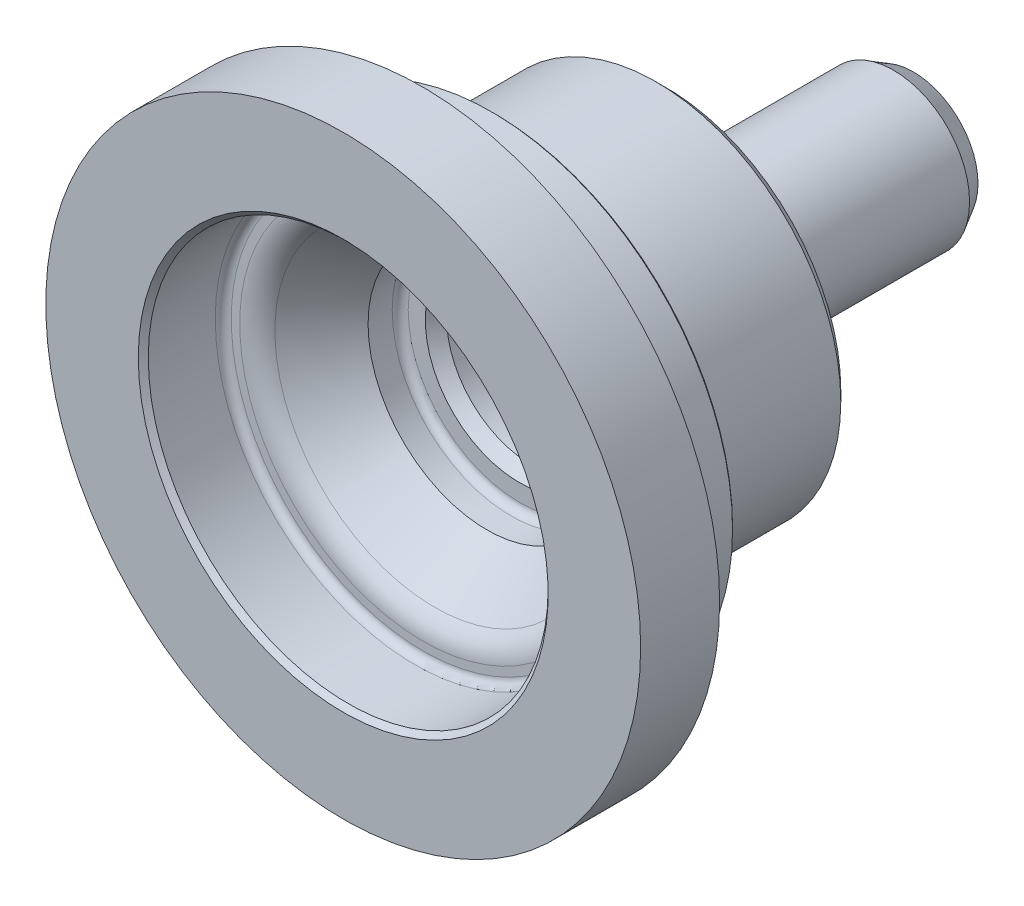
ISO-10303-21;
HEADER;
FILE_DESCRIPTION(('STEP AP214'),'2;1');
FILE_NAME('part.step','',(''),(''),'','','');
FILE_SCHEMA(('AUTOMOTIVE_DESIGN { 1 0 10303 214 1 1 1 1 }'));
ENDSEC;
DATA;
#1=APPLICATION_CONTEXT('core data for automotive mechanical design processes');
#2=APPLICATION_PROTOCOL_DEFINITION('international standard','automotive_design',2000,#1);
#3=PRODUCT_CONTEXT('',#1,'mechanical');
#4=PRODUCT('Part','Part','',(#3));
#5=PRODUCT_RELATED_PRODUCT_CATEGORY('part','',(#4));
#6=PRODUCT_DEFINITION_FORMATION('','',#4);
#7=PRODUCT_DEFINITION_CONTEXT('part definition',#1,'design');
#8=PRODUCT_DEFINITION('design','',#6,#7);
#9=PRODUCT_DEFINITION_SHAPE('','',#8);
#10=(LENGTH_UNIT() NAMED_UNIT(*) SI_UNIT(.MILLI.,.METRE.));
#11=(NAMED_UNIT(*) PLANE_ANGLE_UNIT() SI_UNIT($,.RADIAN.));
#12=(NAMED_UNIT(*) SI_UNIT($,.STERADIAN.) SOLID_ANGLE_UNIT());
#13=UNCERTAINTY_MEASURE_WITH_UNIT(LENGTH_MEASURE(1.E-05),#10,'distance_accuracy_value','');
#14=(GEOMETRIC_REPRESENTATION_CONTEXT(3) GLOBAL_UNCERTAINTY_ASSIGNED_CONTEXT((#13)) GLOBAL_UNIT_ASSIGNED_CONTEXT((#10,
#11,#12)) REPRESENTATION_CONTEXT('',''));
#15=CARTESIAN_POINT('',(0.,0.,0.));
#16=DIRECTION('',(0.,0.,1.));
#17=DIRECTION('',(1.,0.,0.));
#18=AXIS2_PLACEMENT_3D('',#15,#16,#17);
#19=CARTESIAN_POINT('',(0.,0.,-57.5));
#20=DIRECTION('',(0.,0.,1.));
#21=DIRECTION('',(1.,0.,0.));
#22=AXIS2_PLACEMENT_3D('',#19,#20,#21);
#23=PLANE('',#22);
#24=CARTESIAN_POINT('',(0.,0.,-57.5));
#25=DIRECTION('',(0.,0.,-1.));
#26=DIRECTION('',(-1.,0.,0.));
#27=AXIS2_PLACEMENT_3D('',#24,#25,#26);
#28=CIRCLE('',#27,3.35);
#29=CARTESIAN_POINT('',(-3.35,0.,-57.5));
#30=VERTEX_POINT('',#29);
#31=EDGE_CURVE('E59',#30,#30,#28,.T.);
#32=ORIENTED_EDGE('',*,*,#31,.F.);
#33=EDGE_LOOP('',(#32));
#34=FACE_BOUND('',#33,.T.);
#35=CARTESIAN_POINT('',(0.,0.,-57.5));
#36=DIRECTION('',(0.,0.,1.));
#37=DIRECTION('',(1.,0.,0.));
#38=AXIS2_PLACEMENT_3D('',#35,#36,#37);
#39=CIRCLE('',#38,5.8);
#40=CARTESIAN_POINT('',(5.8,0.,-57.5));
#41=VERTEX_POINT('',#40);
#42=EDGE_CURVE('E137',#41,#41,#39,.T.);
#43=ORIENTED_EDGE('',*,*,#42,.F.);
#44=EDGE_LOOP('',(#43));
#45=FACE_BOUND('',#44,.T.);
#46=ADVANCED_FACE('F33',(#34,#45),#23,.F.);
#47=CARTESIAN_POINT('',(0.,0.,-57.5));
#48=DIRECTION('',(0.,0.,1.));
#49=DIRECTION('',(1.,0.,0.));
#50=AXIS2_PLACEMENT_3D('',#47,#48,#49);
#51=CONICAL_SURFACE('',#50,5.8,0.959931088596885);
#52=CARTESIAN_POINT('',(0.,0.,-57.0469054236153));
#53=DIRECTION('',(0.,0.,1.));
#54=DIRECTION('',(1.,0.,0.));
#55=AXIS2_PLACEMENT_3D('',#52,#53,#54);
#56=CIRCLE('',#55,6.44708611612951);
#57=CARTESIAN_POINT('',(6.44708611612951,0.,-57.0469054236153));
#58=VERTEX_POINT('',#57);
#59=EDGE_CURVE('E134',#58,#58,#56,.T.);
#60=ORIENTED_EDGE('',*,*,#59,.F.);
#61=EDGE_LOOP('',(#60));
#62=FACE_BOUND('',#61,.T.);
#63=ORIENTED_EDGE('',*,*,#42,.T.);
#64=EDGE_LOOP('',(#63));
#65=FACE_BOUND('',#64,.T.);
#66=ADVANCED_FACE('F167',(#62,#65),#51,.T.);
#67=CARTESIAN_POINT('',(0.,0.,-57.0469054236153));
#68=DIRECTION('',(0.,0.,1.));
#69=DIRECTION('',(1.,0.,0.));
#70=AXIS2_PLACEMENT_3D('',#67,#68,#69);
#71=CONICAL_SURFACE('',#70,6.44708611612951,0.523598775598292);
#72=CARTESIAN_POINT('',(0.,0.,-55.05));
#73=DIRECTION('',(0.,0.,1.));
#74=DIRECTION('',(1.,0.,0.));
#75=AXIS2_PLACEMENT_3D('',#72,#73,#74);
#76=CIRCLE('',#75,7.6);
#77=CARTESIAN_POINT('',(7.6,0.,-55.05));
#78=VERTEX_POINT('',#77);
#79=EDGE_CURVE('E131',#78,#78,#76,.T.);
#80=ORIENTED_EDGE('',*,*,#79,.F.);
#81=EDGE_LOOP('',(#80));
#82=FACE_BOUND('',#81,.T.);
#83=ORIENTED_EDGE('',*,*,#59,.T.);
#84=EDGE_LOOP('',(#83));
#85=FACE_BOUND('',#84,.T.);
#86=ADVANCED_FACE('F173',(#82,#85),#71,.T.);
#87=CARTESIAN_POINT('',(0.,0.,0.));
#88=DIRECTION('',(0.,0.,1.));
#89=DIRECTION('',(1.,0.,0.));
#90=AXIS2_PLACEMENT_3D('',#87,#88,#89);
#91=CYLINDRICAL_SURFACE('',#90,7.6);
#92=CARTESIAN_POINT('',(0.,0.,-36.7062361110425));
#93=DIRECTION('',(0.,0.,1.));
#94=DIRECTION('',(1.,0.,0.));
#95=AXIS2_PLACEMENT_3D('',#92,#93,#94);
#96=CIRCLE('',#95,7.6);
#97=CARTESIAN_POINT('',(7.6,0.,-36.7062361110425));
#98=VERTEX_POINT('',#97);
#99=EDGE_CURVE('E128',#98,#98,#96,.T.);
#100=ORIENTED_EDGE('',*,*,#99,.F.);
#101=EDGE_LOOP('',(#100));
#102=FACE_BOUND('',#101,.T.);
#103=ORIENTED_EDGE('',*,*,#79,.T.);
#104=EDGE_LOOP('',(#103));
#105=FACE_BOUND('',#104,.T.);
#106=ADVANCED_FACE('F220',(#102,#105),#91,.T.);
#107=CARTESIAN_POINT('',(0.,0.,-35.3));
#108=DIRECTION('',(0.,0.,1.));
#109=DIRECTION('',(1.,0.,0.));
#110=AXIS2_PLACEMENT_3D('',#107,#108,#109);
#111=TOROIDAL_SURFACE('',#110,10.25,3.);
#112=CARTESIAN_POINT('',(0.,0.,-32.3));
#113=DIRECTION('',(0.,0.,1.));
#114=DIRECTION('',(1.,0.,0.));
#115=AXIS2_PLACEMENT_3D('',#112,#113,#114);
#116=CIRCLE('',#115,10.25);
#117=CARTESIAN_POINT('',(10.25,0.,-32.3));
#118=VERTEX_POINT('',#117);
#119=EDGE_CURVE('E125',#118,#118,#116,.T.);
#120=ORIENTED_EDGE('',*,*,#119,.F.);
#121=EDGE_LOOP('',(#120));
#122=FACE_BOUND('',#121,.T.);
#123=ORIENTED_EDGE('',*,*,#99,.T.);
#124=EDGE_LOOP('',(#123));
#125=FACE_BOUND('',#124,.T.);
#126=ADVANCED_FACE('F216',(#122,#125),#111,.F.);
#127=CARTESIAN_POINT('',(0.,10.25,-32.3));
#128=DIRECTION('',(0.,0.,1.));
#129=DIRECTION('',(1.,0.,0.));
#130=AXIS2_PLACEMENT_3D('',#127,#128,#129);
#131=PLANE('',#130);
#132=CARTESIAN_POINT('',(0.,0.,-32.3));
#133=DIRECTION('',(0.,0.,1.));
#134=DIRECTION('',(1.,0.,0.));
#135=AXIS2_PLACEMENT_3D('',#132,#133,#134);
#136=CIRCLE('',#135,17.47);
#137=CARTESIAN_POINT('',(17.47,0.,-32.3));
#138=VERTEX_POINT('',#137);
#139=EDGE_CURVE('E143',#138,#138,#136,.F.);
#140=ORIENTED_EDGE('',*,*,#139,.T.);
#141=EDGE_LOOP('',(#140));
#142=FACE_BOUND('',#141,.T.);
#143=ORIENTED_EDGE('',*,*,#119,.T.);
#144=EDGE_LOOP('',(#143));
#145=FACE_BOUND('',#144,.T.);
#146=ADVANCED_FACE('F197',(#142,#145),#131,.F.);
#147=CARTESIAN_POINT('',(0.,0.,0.));
#148=DIRECTION('',(0.,0.,1.));
#149=DIRECTION('',(1.,0.,0.));
#150=AXIS2_PLACEMENT_3D('',#147,#148,#149);
#151=CYLINDRICAL_SURFACE('',#150,18.47);
#152=CARTESIAN_POINT('',(0.,0.,-31.3));
#153=DIRECTION('',(0.,0.,1.));
#154=DIRECTION('',(1.,0.,0.));
#155=AXIS2_PLACEMENT_3D('',#152,#153,#154);
#156=CIRCLE('',#155,18.47);
#157=CARTESIAN_POINT('',(18.47,0.,-31.3));
#158=VERTEX_POINT('',#157);
#159=EDGE_CURVE('E140',#158,#158,#156,.T.);
#160=ORIENTED_EDGE('',*,*,#159,.T.);
#161=EDGE_LOOP('',(#160));
#162=FACE_BOUND('',#161,.T.);
#163=CARTESIAN_POINT('',(0.,0.,-18.85));
#164=DIRECTION('',(0.,0.,1.));
#165=DIRECTION('',(1.,0.,0.));
#166=AXIS2_PLACEMENT_3D('',#163,#164,#165);
#167=CIRCLE('',#166,18.47);
#168=CARTESIAN_POINT('',(18.47,0.,-18.85));
#169=VERTEX_POINT('',#168);
#170=EDGE_CURVE('E122',#169,#169,#167,.T.);
#171=ORIENTED_EDGE('',*,*,#170,.F.);
#172=EDGE_LOOP('',(#171));
#173=FACE_BOUND('',#172,.T.);
#174=ADVANCED_FACE('F193',(#162,#173),#151,.T.);
#175=CARTESIAN_POINT('',(0.,0.,-18.85));
#176=DIRECTION('',(0.,0.,-1.));
#177=DIRECTION('',(-1.,0.,0.));
#178=AXIS2_PLACEMENT_3D('',#175,#176,#177);
#179=CONICAL_SURFACE('',#178,18.47,0.523598775598301);
#180=CARTESIAN_POINT('',(0.,0.,-17.0833081762798));
#181=DIRECTION('',(0.,0.,1.));
#182=DIRECTION('',(1.,0.,0.));
#183=AXIS2_PLACEMENT_3D('',#180,#181,#182);
#184=CIRCLE('',#183,17.45);
#185=CARTESIAN_POINT('',(17.45,0.,-17.0833081762798));
#186=VERTEX_POINT('',#185);
#187=EDGE_CURVE('E119',#186,#186,#184,.T.);
#188=ORIENTED_EDGE('',*,*,#187,.F.);
#189=EDGE_LOOP('',(#188));
#190=FACE_BOUND('',#189,.T.);
#191=ORIENTED_EDGE('',*,*,#170,.T.);
#192=EDGE_LOOP('',(#191));
#193=FACE_BOUND('',#192,.T.);
#194=ADVANCED_FACE('F196',(#190,#193),#179,.T.);
#195=CARTESIAN_POINT('',(0.,0.,0.));
#196=DIRECTION('',(0.,0.,1.));
#197=DIRECTION('',(1.,0.,0.));
#198=AXIS2_PLACEMENT_3D('',#195,#196,#197);
#199=CYLINDRICAL_SURFACE('',#198,17.45);
#200=CARTESIAN_POINT('',(0.,0.,-16.07));
#201=DIRECTION('',(0.,0.,1.));
#202=DIRECTION('',(1.,0.,0.));
#203=AXIS2_PLACEMENT_3D('',#200,#201,#202);
#204=CIRCLE('',#203,17.45);
#205=CARTESIAN_POINT('',(17.45,0.,-16.07));
#206=VERTEX_POINT('',#205);
#207=EDGE_CURVE('E116',#206,#206,#204,.T.);
#208=ORIENTED_EDGE('',*,*,#207,.F.);
#209=EDGE_LOOP('',(#208));
#210=FACE_BOUND('',#209,.T.);
#211=ORIENTED_EDGE('',*,*,#187,.T.);
#212=EDGE_LOOP('',(#211));
#213=FACE_BOUND('',#212,.T.);
#214=ADVANCED_FACE('F202',(#210,#213),#199,.T.);
#215=CARTESIAN_POINT('',(0.,0.,-16.07));
#216=DIRECTION('',(0.,0.,1.));
#217=DIRECTION('',(1.,0.,0.));
#218=AXIS2_PLACEMENT_3D('',#215,#216,#217);
#219=TOROIDAL_SURFACE('',#218,18.47,1.01999999999999);
#220=CARTESIAN_POINT('',(0.,0.,-15.05));
#221=DIRECTION('',(0.,0.,1.));
#222=DIRECTION('',(1.,0.,0.));
#223=AXIS2_PLACEMENT_3D('',#220,#221,#222);
#224=CIRCLE('',#223,18.47);
#225=CARTESIAN_POINT('',(18.47,0.,-15.05));
#226=VERTEX_POINT('',#225);
#227=EDGE_CURVE('E113',#226,#226,#224,.T.);
#228=ORIENTED_EDGE('',*,*,#227,.F.);
#229=EDGE_LOOP('',(#228));
#230=FACE_BOUND('',#229,.T.);
#231=ORIENTED_EDGE('',*,*,#207,.T.);
#232=EDGE_LOOP('',(#231));
#233=FACE_BOUND('',#232,.T.);
#234=ADVANCED_FACE('F208',(#230,#233),#219,.F.);
#235=CARTESIAN_POINT('',(0.,18.47,-15.05));
#236=DIRECTION('',(0.,0.,1.));
#237=DIRECTION('',(1.,0.,0.));
#238=AXIS2_PLACEMENT_3D('',#235,#236,#237);
#239=PLANE('',#238);
#240=CARTESIAN_POINT('',(0.,0.,-15.05));
#241=DIRECTION('',(0.,0.,1.));
#242=DIRECTION('',(1.,0.,0.));
#243=AXIS2_PLACEMENT_3D('',#240,#241,#242);
#244=CIRCLE('',#243,23.8925);
#245=CARTESIAN_POINT('',(23.8925,0.,-15.05));
#246=VERTEX_POINT('',#245);
#247=EDGE_CURVE('E149',#246,#246,#244,.F.);
#248=ORIENTED_EDGE('',*,*,#247,.T.);
#249=EDGE_LOOP('',(#248));
#250=FACE_BOUND('',#249,.T.);
#251=ORIENTED_EDGE('',*,*,#227,.T.);
#252=EDGE_LOOP('',(#251));
#253=FACE_BOUND('',#252,.T.);
#254=ADVANCED_FACE('F265',(#250,#253),#239,.F.);
#255=CARTESIAN_POINT('',(0.,0.,0.));
#256=DIRECTION('',(0.,0.,1.));
#257=DIRECTION('',(1.,0.,0.));
#258=AXIS2_PLACEMENT_3D('',#255,#256,#257);
#259=CYLINDRICAL_SURFACE('',#258,24.1125);
#260=CARTESIAN_POINT('',(0.,0.,-14.83));
#261=DIRECTION('',(0.,0.,1.));
#262=DIRECTION('',(1.,0.,0.));
#263=AXIS2_PLACEMENT_3D('',#260,#261,#262);
#264=CIRCLE('',#263,24.1125);
#265=CARTESIAN_POINT('',(24.1125,0.,-14.83));
#266=VERTEX_POINT('',#265);
#267=EDGE_CURVE('E146',#266,#266,#264,.T.);
#268=ORIENTED_EDGE('',*,*,#267,.T.);
#269=EDGE_LOOP('',(#268));
#270=FACE_BOUND('',#269,.T.);
#271=CARTESIAN_POINT('',(0.,0.,-7.15));
#272=DIRECTION('',(0.,0.,1.));
#273=DIRECTION('',(1.,0.,0.));
#274=AXIS2_PLACEMENT_3D('',#271,#272,#273);
#275=CIRCLE('',#274,24.1125);
#276=CARTESIAN_POINT('',(24.1125,0.,-7.15));
#277=VERTEX_POINT('',#276);
#278=EDGE_CURVE('E110',#277,#277,#275,.T.);
#279=ORIENTED_EDGE('',*,*,#278,.F.);
#280=EDGE_LOOP('',(#279));
#281=FACE_BOUND('',#280,.T.);
#282=ADVANCED_FACE('F270',(#270,#281),#259,.T.);
#283=CARTESIAN_POINT('',(0.,0.,-7.15));
#284=DIRECTION('',(0.,0.,1.));
#285=DIRECTION('',(1.,0.,0.));
#286=AXIS2_PLACEMENT_3D('',#283,#284,#285);
#287=TOROIDAL_SURFACE('',#286,24.7125,0.599999999999999);
#288=CARTESIAN_POINT('',(0.,0.,-6.63038475772934));
#289=DIRECTION('',(0.,0.,1.));
#290=DIRECTION('',(1.,0.,0.));
#291=AXIS2_PLACEMENT_3D('',#288,#289,#290);
#292=CIRCLE('',#291,25.0125);
#293=CARTESIAN_POINT('',(25.0125,0.,-6.63038475772934));
#294=VERTEX_POINT('',#293);
#295=EDGE_CURVE('E107',#294,#294,#292,.T.);
#296=ORIENTED_EDGE('',*,*,#295,.F.);
#297=EDGE_LOOP('',(#296));
#298=FACE_BOUND('',#297,.T.);
#299=ORIENTED_EDGE('',*,*,#278,.T.);
#300=EDGE_LOOP('',(#299));
#301=FACE_BOUND('',#300,.T.);
#302=ADVANCED_FACE('F283',(#298,#301),#287,.F.);
#303=CARTESIAN_POINT('',(0.,0.,-6.63038475772934));
#304=DIRECTION('',(0.,0.,-1.));
#305=DIRECTION('',(-1.,0.,0.));
#306=AXIS2_PLACEMENT_3D('',#303,#304,#305);
#307=CONICAL_SURFACE('',#306,25.0125,1.0471975511966);
#308=CARTESIAN_POINT('',(0.,0.,-7.9));
#309=DIRECTION('',(0.,0.,1.));
#310=DIRECTION('',(1.,0.,0.));
#311=AXIS2_PLACEMENT_3D('',#308,#309,#310);
#312=CIRCLE('',#311,27.2115381056767);
#313=CARTESIAN_POINT('',(27.2115381056767,0.,-7.9));
#314=VERTEX_POINT('',#313);
#315=EDGE_CURVE('E104',#314,#314,#312,.T.);
#316=ORIENTED_EDGE('',*,*,#315,.F.);
#317=EDGE_LOOP('',(#316));
#318=FACE_BOUND('',#317,.T.);
#319=ORIENTED_EDGE('',*,*,#295,.T.);
#320=EDGE_LOOP('',(#319));
#321=FACE_BOUND('',#320,.T.);
#322=ADVANCED_FACE('F405',(#318,#321),#307,.F.);
#323=CARTESIAN_POINT('',(0.,27.2115381056767,-7.9));
#324=DIRECTION('',(0.,0.,1.));
#325=DIRECTION('',(1.,0.,0.));
#326=AXIS2_PLACEMENT_3D('',#323,#324,#325);
#327=PLANE('',#326);
#328=CARTESIAN_POINT('',(0.,0.,-7.9));
#329=DIRECTION('',(0.,0.,1.));
#330=DIRECTION('',(1.,0.,0.));
#331=AXIS2_PLACEMENT_3D('',#328,#329,#330);
#332=CIRCLE('',#331,29.75);
#333=CARTESIAN_POINT('',(29.75,0.,-7.9));
#334=VERTEX_POINT('',#333);
#335=EDGE_CURVE('E101',#334,#334,#332,.T.);
#336=ORIENTED_EDGE('',*,*,#335,.F.);
#337=EDGE_LOOP('',(#336));
#338=FACE_BOUND('',#337,.T.);
#339=ORIENTED_EDGE('',*,*,#315,.T.);
#340=EDGE_LOOP('',(#339));
#341=FACE_BOUND('',#340,.T.);
#342=ADVANCED_FACE('F401',(#338,#341),#327,.F.);
#343=CARTESIAN_POINT('',(0.,0.,0.));
#344=DIRECTION('',(0.,0.,1.));
#345=DIRECTION('',(1.,0.,0.));
#346=AXIS2_PLACEMENT_3D('',#343,#344,#345);
#347=CYLINDRICAL_SURFACE('',#346,29.75);
#348=CARTESIAN_POINT('',(0.,0.,0.));
#349=DIRECTION('',(0.,0.,1.));
#350=DIRECTION('',(1.,0.,0.));
#351=AXIS2_PLACEMENT_3D('',#348,#349,#350);
#352=CIRCLE('',#351,29.75);
#353=CARTESIAN_POINT('',(29.75,0.,0.));
#354=VERTEX_POINT('',#353);
#355=EDGE_CURVE('E98',#354,#354,#352,.T.);
#356=ORIENTED_EDGE('',*,*,#355,.F.);
#357=EDGE_LOOP('',(#356));
#358=FACE_BOUND('',#357,.T.);
#359=ORIENTED_EDGE('',*,*,#335,.T.);
#360=EDGE_LOOP('',(#359));
#361=FACE_BOUND('',#360,.T.);
#362=ADVANCED_FACE('F302',(#358,#361),#347,.T.);
#363=CARTESIAN_POINT('',(0.,29.75,0.));
#364=DIRECTION('',(0.,0.,-1.));
#365=DIRECTION('',(-1.,0.,0.));
#366=AXIS2_PLACEMENT_3D('',#363,#364,#365);
#367=PLANE('',#366);
#368=CARTESIAN_POINT('',(0.,0.,0.));
#369=DIRECTION('',(0.,0.,-1.));
#370=DIRECTION('',(-1.,0.,0.));
#371=AXIS2_PLACEMENT_3D('',#368,#369,#370);
#372=CIRCLE('',#371,20.5);
#373=CARTESIAN_POINT('',(-20.5,0.,0.));
#374=VERTEX_POINT('',#373);
#375=EDGE_CURVE('E11',#374,#374,#372,.T.);
#376=ORIENTED_EDGE('',*,*,#375,.T.);
#377=EDGE_LOOP('',(#376));
#378=FACE_BOUND('',#377,.T.);
#379=ORIENTED_EDGE('',*,*,#355,.T.);
#380=EDGE_LOOP('',(#379));
#381=FACE_BOUND('',#380,.T.);
#382=ADVANCED_FACE('F297',(#378,#381),#367,.F.);
#383=CARTESIAN_POINT('',(0.,0.,0.));
#384=DIRECTION('',(0.,0.,1.));
#385=DIRECTION('',(1.,0.,0.));
#386=AXIS2_PLACEMENT_3D('',#383,#384,#385);
#387=CYLINDRICAL_SURFACE('',#386,20.);
#388=CARTESIAN_POINT('',(0.,0.,-0.500000000000005));
#389=DIRECTION('',(0.,0.,-1.));
#390=DIRECTION('',(-1.,0.,0.));
#391=AXIS2_PLACEMENT_3D('',#388,#389,#390);
#392=CIRCLE('',#391,20.);
#393=CARTESIAN_POINT('',(-20.,0.,-0.500000000000005));
#394=VERTEX_POINT('',#393);
#395=EDGE_CURVE('E40',#394,#394,#392,.F.);
#396=ORIENTED_EDGE('',*,*,#395,.T.);
#397=EDGE_LOOP('',(#396));
#398=FACE_BOUND('',#397,.T.);
#399=CARTESIAN_POINT('',(0.,0.,-7.2));
#400=DIRECTION('',(0.,0.,1.));
#401=DIRECTION('',(1.,0.,0.));
#402=AXIS2_PLACEMENT_3D('',#399,#400,#401);
#403=CIRCLE('',#402,20.);
#404=CARTESIAN_POINT('',(20.,0.,-7.2));
#405=VERTEX_POINT('',#404);
#406=EDGE_CURVE('E95',#405,#405,#403,.T.);
#407=ORIENTED_EDGE('',*,*,#406,.F.);
#408=EDGE_LOOP('',(#407));
#409=FACE_BOUND('',#408,.T.);
#410=ADVANCED_FACE('F154',(#398,#409),#387,.F.);
#411=CARTESIAN_POINT('',(0.,0.,-7.2));
#412=DIRECTION('',(0.,0.,1.));
#413=DIRECTION('',(1.,0.,0.));
#414=AXIS2_PLACEMENT_3D('',#411,#412,#413);
#415=TOROIDAL_SURFACE('',#414,19.2,0.800000000000002);
#416=CARTESIAN_POINT('',(0.,0.,-8.));
#417=DIRECTION('',(0.,0.,1.));
#418=DIRECTION('',(1.,0.,0.));
#419=AXIS2_PLACEMENT_3D('',#416,#417,#418);
#420=CIRCLE('',#419,19.2);
#421=CARTESIAN_POINT('',(19.2,0.,-8.));
#422=VERTEX_POINT('',#421);
#423=EDGE_CURVE('E92',#422,#422,#420,.T.);
#424=ORIENTED_EDGE('',*,*,#423,.F.);
#425=EDGE_LOOP('',(#424));
#426=FACE_BOUND('',#425,.T.);
#427=ORIENTED_EDGE('',*,*,#406,.T.);
#428=EDGE_LOOP('',(#427));
#429=FACE_BOUND('',#428,.T.);
#430=ADVANCED_FACE('F313',(#426,#429),#415,.F.);
#431=CARTESIAN_POINT('',(0.,19.2,-8.));
#432=DIRECTION('',(0.,0.,-1.));
#433=DIRECTION('',(-1.,0.,0.));
#434=AXIS2_PLACEMENT_3D('',#431,#432,#433);
#435=PLANE('',#434);
#436=CARTESIAN_POINT('',(0.,0.,-8.));
#437=DIRECTION('',(0.,0.,1.));
#438=DIRECTION('',(1.,0.,0.));
#439=AXIS2_PLACEMENT_3D('',#436,#437,#438);
#440=CIRCLE('',#439,18.3510825319701);
#441=CARTESIAN_POINT('',(18.3510825319701,0.,-8.));
#442=VERTEX_POINT('',#441);
#443=EDGE_CURVE('E89',#442,#442,#440,.T.);
#444=ORIENTED_EDGE('',*,*,#443,.F.);
#445=EDGE_LOOP('',(#444));
#446=FACE_BOUND('',#445,.T.);
#447=ORIENTED_EDGE('',*,*,#423,.T.);
#448=EDGE_LOOP('',(#447));
#449=FACE_BOUND('',#448,.T.);
#450=ADVANCED_FACE('F393',(#446,#449),#435,.F.);
#451=CARTESIAN_POINT('',(0.,0.,-11.));
#452=DIRECTION('',(0.,0.,1.));
#453=DIRECTION('',(1.,0.,0.));
#454=AXIS2_PLACEMENT_3D('',#451,#452,#453);
#455=TOROIDAL_SURFACE('',#454,18.3510825319701,3.);
#456=CARTESIAN_POINT('',(0.,0.,-9.15301557402302));
#457=DIRECTION('',(0.,0.,1.));
#458=DIRECTION('',(1.,0.,0.));
#459=AXIS2_PLACEMENT_3D('',#456,#457,#458);
#460=CIRCLE('',#459,15.98705027115);
#461=CARTESIAN_POINT('',(15.98705027115,0.,-9.15301557402302));
#462=VERTEX_POINT('',#461);
#463=EDGE_CURVE('E86',#462,#462,#460,.T.);
#464=ORIENTED_EDGE('',*,*,#463,.F.);
#465=EDGE_LOOP('',(#464));
#466=FACE_BOUND('',#465,.T.);
#467=ORIENTED_EDGE('',*,*,#443,.T.);
#468=EDGE_LOOP('',(#467));
#469=FACE_BOUND('',#468,.T.);
#470=ADVANCED_FACE('F389',(#466,#469),#455,.T.);
#471=CARTESIAN_POINT('',(0.,0.,-9.15301557402302));
#472=DIRECTION('',(0.,0.,1.));
#473=DIRECTION('',(1.,0.,0.));
#474=AXIS2_PLACEMENT_3D('',#471,#472,#473);
#475=CONICAL_SURFACE('',#474,15.98705027115,0.663225115757847);
#476=CARTESIAN_POINT('',(0.,0.,-14.3842013689339));
#477=DIRECTION('',(0.,0.,1.));
#478=DIRECTION('',(1.,0.,0.));
#479=AXIS2_PLACEMENT_3D('',#476,#477,#478);
#480=CIRCLE('',#479,11.9);
#481=CARTESIAN_POINT('',(11.9,0.,-14.3842013689339));
#482=VERTEX_POINT('',#481);
#483=EDGE_CURVE('E83',#482,#482,#480,.T.);
#484=ORIENTED_EDGE('',*,*,#483,.F.);
#485=EDGE_LOOP('',(#484));
#486=FACE_BOUND('',#485,.T.);
#487=ORIENTED_EDGE('',*,*,#463,.T.);
#488=EDGE_LOOP('',(#487));
#489=FACE_BOUND('',#488,.T.);
#490=ADVANCED_FACE('F385',(#486,#489),#475,.F.);
#491=CARTESIAN_POINT('',(0.,0.,0.));
#492=DIRECTION('',(0.,0.,1.));
#493=DIRECTION('',(1.,0.,0.));
#494=AXIS2_PLACEMENT_3D('',#491,#492,#493);
#495=CYLINDRICAL_SURFACE('',#494,11.9);
#496=CARTESIAN_POINT('',(0.,0.,-16.8));
#497=DIRECTION('',(0.,0.,1.));
#498=DIRECTION('',(1.,0.,0.));
#499=AXIS2_PLACEMENT_3D('',#496,#497,#498);
#500=CIRCLE('',#499,11.9);
#501=CARTESIAN_POINT('',(11.9,0.,-16.8));
#502=VERTEX_POINT('',#501);
#503=EDGE_CURVE('E80',#502,#502,#500,.T.);
#504=ORIENTED_EDGE('',*,*,#503,.F.);
#505=EDGE_LOOP('',(#504));
#506=FACE_BOUND('',#505,.T.);
#507=ORIENTED_EDGE('',*,*,#483,.T.);
#508=EDGE_LOOP('',(#507));
#509=FACE_BOUND('',#508,.T.);
#510=ADVANCED_FACE('F381',(#506,#509),#495,.F.);
#511=CARTESIAN_POINT('',(0.,0.,-16.8));
#512=DIRECTION('',(0.,0.,1.));
#513=DIRECTION('',(1.,0.,0.));
#514=AXIS2_PLACEMENT_3D('',#511,#512,#513);
#515=TOROIDAL_SURFACE('',#514,11.1,0.800000000000002);
#516=CARTESIAN_POINT('',(0.,0.,-17.6));
#517=DIRECTION('',(0.,0.,1.));
#518=DIRECTION('',(1.,0.,0.));
#519=AXIS2_PLACEMENT_3D('',#516,#517,#518);
#520=CIRCLE('',#519,11.1);
#521=CARTESIAN_POINT('',(11.1,0.,-17.6));
#522=VERTEX_POINT('',#521);
#523=EDGE_CURVE('E77',#522,#522,#520,.T.);
#524=ORIENTED_EDGE('',*,*,#523,.F.);
#525=EDGE_LOOP('',(#524));
#526=FACE_BOUND('',#525,.T.);
#527=ORIENTED_EDGE('',*,*,#503,.T.);
#528=EDGE_LOOP('',(#527));
#529=FACE_BOUND('',#528,.T.);
#530=ADVANCED_FACE('F377',(#526,#529),#515,.F.);
#531=CARTESIAN_POINT('',(0.,9.38754275180806,-17.6));
#532=DIRECTION('',(0.,0.,-1.));
#533=DIRECTION('',(-1.,0.,0.));
#534=AXIS2_PLACEMENT_3D('',#531,#532,#533);
#535=PLANE('',#534);
#536=CARTESIAN_POINT('',(0.,0.,-17.6));
#537=DIRECTION('',(0.,0.,1.));
#538=DIRECTION('',(1.,0.,0.));
#539=AXIS2_PLACEMENT_3D('',#536,#537,#538);
#540=CIRCLE('',#539,9.38754275180806);
#541=CARTESIAN_POINT('',(9.38754275180806,0.,-17.6));
#542=VERTEX_POINT('',#541);
#543=EDGE_CURVE('E74',#542,#542,#540,.T.);
#544=ORIENTED_EDGE('',*,*,#543,.F.);
#545=EDGE_LOOP('',(#544));
#546=FACE_BOUND('',#545,.T.);
#547=ORIENTED_EDGE('',*,*,#523,.T.);
#548=EDGE_LOOP('',(#547));
#549=FACE_BOUND('',#548,.T.);
#550=ADVANCED_FACE('F373',(#546,#549),#535,.F.);
#551=CARTESIAN_POINT('',(0.,0.,-17.6));
#552=DIRECTION('',(0.,0.,1.));
#553=DIRECTION('',(1.,0.,0.));
#554=AXIS2_PLACEMENT_3D('',#551,#552,#553);
#555=CONICAL_SURFACE('',#554,9.38754275180806,0.663225115757847);
#556=CARTESIAN_POINT('',(0.,0.,-18.8));
#557=DIRECTION('',(0.,0.,1.));
#558=DIRECTION('',(1.,0.,0.));
#559=AXIS2_PLACEMENT_3D('',#556,#557,#558);
#560=CIRCLE('',#559,8.45);
#561=CARTESIAN_POINT('',(8.45,0.,-18.8));
#562=VERTEX_POINT('',#561);
#563=EDGE_CURVE('E71',#562,#562,#560,.T.);
#564=ORIENTED_EDGE('',*,*,#563,.F.);
#565=EDGE_LOOP('',(#564));
#566=FACE_BOUND('',#565,.T.);
#567=ORIENTED_EDGE('',*,*,#543,.T.);
#568=EDGE_LOOP('',(#567));
#569=FACE_BOUND('',#568,.T.);
#570=ADVANCED_FACE('F369',(#566,#569),#555,.F.);
#571=CARTESIAN_POINT('',(0.,0.,0.));
#572=DIRECTION('',(0.,0.,1.));
#573=DIRECTION('',(1.,0.,0.));
#574=AXIS2_PLACEMENT_3D('',#571,#572,#573);
#575=CYLINDRICAL_SURFACE('',#574,8.45);
#576=CARTESIAN_POINT('',(0.,0.,-26.5));
#577=DIRECTION('',(0.,0.,1.));
#578=DIRECTION('',(1.,0.,0.));
#579=AXIS2_PLACEMENT_3D('',#576,#577,#578);
#580=CIRCLE('',#579,8.45);
#581=CARTESIAN_POINT('',(8.45,0.,-26.5));
#582=VERTEX_POINT('',#581);
#583=EDGE_CURVE('E68',#582,#582,#580,.T.);
#584=ORIENTED_EDGE('',*,*,#583,.F.);
#585=EDGE_LOOP('',(#584));
#586=FACE_BOUND('',#585,.T.);
#587=ORIENTED_EDGE('',*,*,#563,.T.);
#588=EDGE_LOOP('',(#587));
#589=FACE_BOUND('',#588,.T.);
#590=ADVANCED_FACE('F365',(#586,#589),#575,.F.);
#591=CARTESIAN_POINT('',(0.,0.,-26.5));
#592=DIRECTION('',(0.,0.,1.));
#593=DIRECTION('',(1.,0.,0.));
#594=AXIS2_PLACEMENT_3D('',#591,#592,#593);
#595=TOROIDAL_SURFACE('',#594,7.65,0.799999999999998);
#596=CARTESIAN_POINT('',(0.,0.,-27.3));
#597=DIRECTION('',(0.,0.,1.));
#598=DIRECTION('',(1.,0.,0.));
#599=AXIS2_PLACEMENT_3D('',#596,#597,#598);
#600=CIRCLE('',#599,7.65);
#601=CARTESIAN_POINT('',(7.65,0.,-27.3));
#602=VERTEX_POINT('',#601);
#603=EDGE_CURVE('E65',#602,#602,#600,.T.);
#604=ORIENTED_EDGE('',*,*,#603,.F.);
#605=EDGE_LOOP('',(#604));
#606=FACE_BOUND('',#605,.T.);
#607=ORIENTED_EDGE('',*,*,#583,.T.);
#608=EDGE_LOOP('',(#607));
#609=FACE_BOUND('',#608,.T.);
#610=ADVANCED_FACE('F361',(#606,#609),#595,.F.);
#611=CARTESIAN_POINT('',(0.,5.5,-27.3));
#612=DIRECTION('',(0.,0.,-1.));
#613=DIRECTION('',(-1.,0.,0.));
#614=AXIS2_PLACEMENT_3D('',#611,#612,#613);
#615=PLANE('',#614);
#616=CARTESIAN_POINT('',(0.,0.,-27.3));
#617=DIRECTION('',(0.,0.,1.));
#618=DIRECTION('',(1.,0.,0.));
#619=AXIS2_PLACEMENT_3D('',#616,#617,#618);
#620=CIRCLE('',#619,5.5);
#621=CARTESIAN_POINT('',(5.5,0.,-27.3));
#622=VERTEX_POINT('',#621);
#623=EDGE_CURVE('E56',#622,#622,#620,.T.);
#624=ORIENTED_EDGE('',*,*,#623,.F.);
#625=EDGE_LOOP('',(#624));
#626=FACE_BOUND('',#625,.T.);
#627=ORIENTED_EDGE('',*,*,#603,.T.);
#628=EDGE_LOOP('',(#627));
#629=FACE_BOUND('',#628,.T.);
#630=ADVANCED_FACE('F357',(#626,#629),#615,.F.);
#631=CARTESIAN_POINT('',(0.,0.,0.));
#632=DIRECTION('',(0.,0.,1.));
#633=DIRECTION('',(1.,0.,0.));
#634=AXIS2_PLACEMENT_3D('',#631,#632,#633);
#635=CYLINDRICAL_SURFACE('',#634,5.5);
#636=CARTESIAN_POINT('',(0.,0.,-31.3));
#637=DIRECTION('',(0.,0.,1.));
#638=DIRECTION('',(1.,0.,0.));
#639=AXIS2_PLACEMENT_3D('',#636,#637,#638);
#640=CIRCLE('',#639,5.5);
#641=CARTESIAN_POINT('',(5.5,0.,-31.3));
#642=VERTEX_POINT('',#641);
#643=EDGE_CURVE('E52',#642,#642,#640,.T.);
#644=ORIENTED_EDGE('',*,*,#643,.F.);
#645=EDGE_LOOP('',(#644));
#646=FACE_BOUND('',#645,.T.);
#647=ORIENTED_EDGE('',*,*,#623,.T.);
#648=EDGE_LOOP('',(#647));
#649=FACE_BOUND('',#648,.T.);
#650=ADVANCED_FACE('F186',(#646,#649),#635,.F.);
#651=CARTESIAN_POINT('',(0.,0.,-31.3));
#652=DIRECTION('',(0.,0.,-1.));
#653=DIRECTION('',(-1.,0.,0.));
#654=AXIS2_PLACEMENT_3D('',#651,#652,#653);
#655=PLANE('',#654);
#656=ORIENTED_EDGE('',*,*,#643,.T.);
#657=EDGE_LOOP('',(#656));
#658=FACE_BOUND('',#657,.T.);
#659=ADVANCED_FACE('F181',(#658),#655,.F.);
#660=CARTESIAN_POINT('',(0.,0.,-31.3));
#661=DIRECTION('',(0.,0.,1.));
#662=DIRECTION('',(1.,0.,0.));
#663=AXIS2_PLACEMENT_3D('',#660,#661,#662);
#664=CONICAL_SURFACE('',#663,18.47,0.785398163397452);
#665=ORIENTED_EDGE('',*,*,#139,.F.);
#666=EDGE_LOOP('',(#665));
#667=FACE_BOUND('',#666,.T.);
#668=ORIENTED_EDGE('',*,*,#159,.F.);
#669=EDGE_LOOP('',(#668));
#670=FACE_BOUND('',#669,.T.);
#671=ADVANCED_FACE('F163',(#667,#670),#664,.T.);
#672=CARTESIAN_POINT('',(0.,0.,-14.83));
#673=DIRECTION('',(0.,0.,1.));
#674=DIRECTION('',(1.,0.,0.));
#675=AXIS2_PLACEMENT_3D('',#672,#673,#674);
#676=CONICAL_SURFACE('',#675,24.1125,0.785398163397448);
#677=ORIENTED_EDGE('',*,*,#247,.F.);
#678=EDGE_LOOP('',(#677));
#679=FACE_BOUND('',#678,.T.);
#680=ORIENTED_EDGE('',*,*,#267,.F.);
#681=EDGE_LOOP('',(#680));
#682=FACE_BOUND('',#681,.T.);
#683=ADVANCED_FACE('F158',(#679,#682),#676,.T.);
#684=CARTESIAN_POINT('',(0.,0.,-0.500000000000005));
#685=DIRECTION('',(0.,0.,1.));
#686=DIRECTION('',(1.,0.,0.));
#687=AXIS2_PLACEMENT_3D('',#684,#685,#686);
#688=CONICAL_SURFACE('',#687,20.,0.785398163397448);
#689=ORIENTED_EDGE('',*,*,#375,.F.);
#690=EDGE_LOOP('',(#689));
#691=FACE_BOUND('',#690,.T.);
#692=ORIENTED_EDGE('',*,*,#395,.F.);
#693=EDGE_LOOP('',(#692));
#694=FACE_BOUND('',#693,.T.);
#695=ADVANCED_FACE('F35',(#691,#694),#688,.F.);
#696=CARTESIAN_POINT('',(0.,0.,-51.));
#697=DIRECTION('',(0.,0.,-1.));
#698=DIRECTION('',(-1.,0.,0.));
#699=AXIS2_PLACEMENT_3D('',#696,#697,#698);
#700=CONICAL_SURFACE('',#699,1.69999999999999,1.02974425867665);
#701=CARTESIAN_POINT('',(0.,0.,-49.9785369476532));
#702=VERTEX_POINT('',#701);
#703=VERTEX_LOOP('',#702);
#704=FACE_BOUND('',#703,.T.);
#705=CARTESIAN_POINT('',(0.,0.,-51.));
#706=DIRECTION('',(0.,0.,-1.));
#707=DIRECTION('',(-1.,0.,0.));
#708=AXIS2_PLACEMENT_3D('',#705,#706,#707);
#709=CIRCLE('',#708,1.69999999999999);
#710=CARTESIAN_POINT('',(-1.69999999999999,0.,-51.));
#711=VERTEX_POINT('',#710);
#712=EDGE_CURVE('E50',#711,#711,#709,.T.);
#713=ORIENTED_EDGE('',*,*,#712,.T.);
#714=EDGE_LOOP('',(#713));
#715=FACE_BOUND('',#714,.T.);
#716=ADVANCED_FACE('F43',(#704,#715),#700,.F.);
#717=CARTESIAN_POINT('',(0.,0.,-57.5));
#718=DIRECTION('',(0.,0.,-1.));
#719=DIRECTION('',(-1.,0.,0.));
#720=AXIS2_PLACEMENT_3D('',#717,#718,#719);
#721=CYLINDRICAL_SURFACE('',#720,1.7);
#722=ORIENTED_EDGE('',*,*,#712,.F.);
#723=EDGE_LOOP('',(#722));
#724=FACE_BOUND('',#723,.T.);
#725=CARTESIAN_POINT('',(0.,0.,-55.85));
#726=DIRECTION('',(0.,0.,-1.));
#727=DIRECTION('',(-1.,0.,0.));
#728=AXIS2_PLACEMENT_3D('',#725,#726,#727);
#729=CIRCLE('',#728,1.7);
#730=CARTESIAN_POINT('',(-1.7,0.,-55.85));
#731=VERTEX_POINT('',#730);
#732=EDGE_CURVE('E53',#731,#731,#729,.T.);
#733=ORIENTED_EDGE('',*,*,#732,.T.);
#734=EDGE_LOOP('',(#733));
#735=FACE_BOUND('',#734,.T.);
#736=ADVANCED_FACE('F46',(#724,#735),#721,.F.);
#737=CARTESIAN_POINT('',(0.,0.,-57.5));
#738=DIRECTION('',(0.,0.,-1.));
#739=DIRECTION('',(-1.,0.,0.));
#740=AXIS2_PLACEMENT_3D('',#737,#738,#739);
#741=CONICAL_SURFACE('',#740,3.35,0.785398163397449);
#742=ORIENTED_EDGE('',*,*,#732,.F.);
#743=EDGE_LOOP('',(#742));
#744=FACE_BOUND('',#743,.T.);
#745=ORIENTED_EDGE('',*,*,#31,.T.);
#746=EDGE_LOOP('',(#745));
#747=FACE_BOUND('',#746,.T.);
#748=ADVANCED_FACE('F339',(#744,#747),#741,.F.);
#749=CLOSED_SHELL('',(#46,#66,#86,#106,#126,#146,#174,#194,#214,#234,#254,#282,#302,#322,#342,
#362,#382,#410,#430,#450,#470,#490,#510,#530,#550,#570,#590,#610,#630,#650,#659,#671,#683,#695,
#716,#736,#748));
#750=MANIFOLD_SOLID_BREP('B2',#749);
#751=ADVANCED_BREP_SHAPE_REPRESENTATION('',(#18,#750),#14);
#752=SHAPE_DEFINITION_REPRESENTATION(#9,#751);
ENDSEC;
END-ISO-10303-21;
